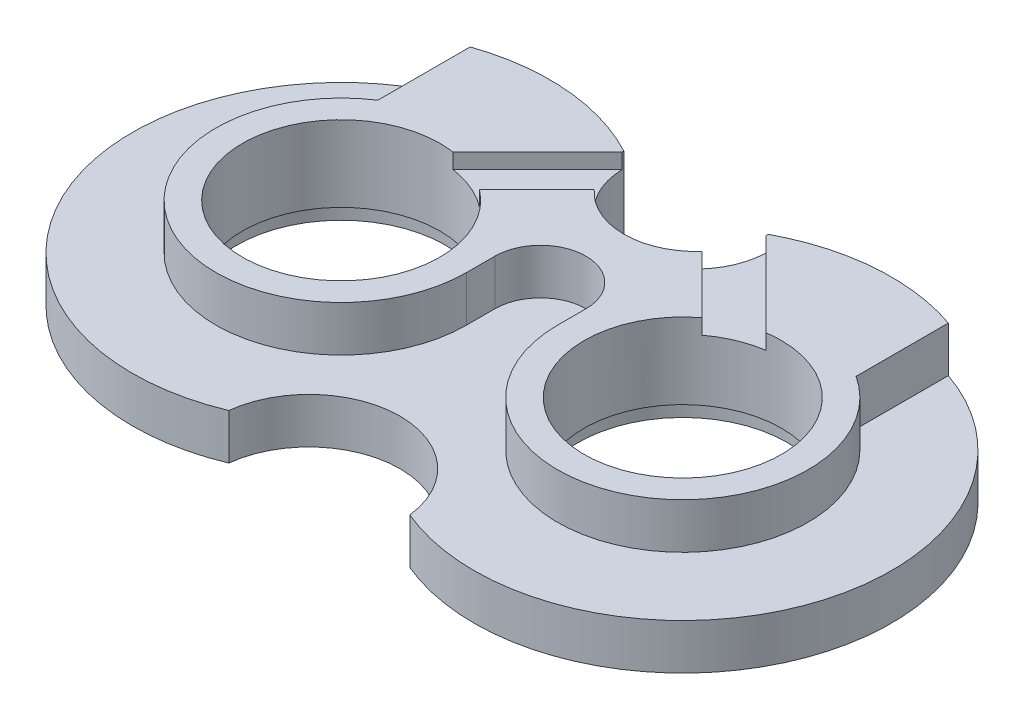
ISO-10303-21;
HEADER;
FILE_DESCRIPTION(('STEP AP214'),'2;1');
FILE_NAME('part.step','',(''),(''),'','','');
FILE_SCHEMA(('AUTOMOTIVE_DESIGN { 1 0 10303 214 1 1 1 1 }'));
ENDSEC;
DATA;
#1=APPLICATION_CONTEXT('core data for automotive mechanical design processes');
#2=APPLICATION_PROTOCOL_DEFINITION('international standard','automotive_design',2000,#1);
#3=PRODUCT_CONTEXT('',#1,'mechanical');
#4=PRODUCT('Part','Part','',(#3));
#5=PRODUCT_RELATED_PRODUCT_CATEGORY('part','',(#4));
#6=PRODUCT_DEFINITION_FORMATION('','',#4);
#7=PRODUCT_DEFINITION_CONTEXT('part definition',#1,'design');
#8=PRODUCT_DEFINITION('design','',#6,#7);
#9=PRODUCT_DEFINITION_SHAPE('','',#8);
#10=(LENGTH_UNIT() NAMED_UNIT(*) SI_UNIT(.MILLI.,.METRE.));
#11=(NAMED_UNIT(*) PLANE_ANGLE_UNIT() SI_UNIT($,.RADIAN.));
#12=(NAMED_UNIT(*) SI_UNIT($,.STERADIAN.) SOLID_ANGLE_UNIT());
#13=UNCERTAINTY_MEASURE_WITH_UNIT(LENGTH_MEASURE(1.E-05),#10,'distance_accuracy_value','');
#14=(GEOMETRIC_REPRESENTATION_CONTEXT(3) GLOBAL_UNCERTAINTY_ASSIGNED_CONTEXT((#13)) GLOBAL_UNIT_ASSIGNED_CONTEXT((#10,
#11,#12)) REPRESENTATION_CONTEXT('',''));
#15=CARTESIAN_POINT('',(0.,0.,0.));
#16=DIRECTION('',(0.,0.,1.));
#17=DIRECTION('',(1.,0.,0.));
#18=AXIS2_PLACEMENT_3D('',#15,#16,#17);
#19=CARTESIAN_POINT('',(22.5,12.,0.));
#20=DIRECTION('',(0.,-1.,0.));
#21=DIRECTION('',(0.,0.,-1.));
#22=AXIS2_PLACEMENT_3D('',#19,#20,#21);
#23=CYLINDRICAL_SURFACE('',#22,13.);
#24=DIRECTION('',(0.,-1.,0.));
#25=VECTOR('',#24,1.);
#26=CARTESIAN_POINT('',(20.6216910683662,12.,-12.8635903058728));
#27=LINE('',#26,#25);
#28=CARTESIAN_POINT('',(20.6216910683662,10.,-12.8635903058728));
#29=VERTEX_POINT('',#28);
#30=CARTESIAN_POINT('',(20.6216910683662,12.,-12.8635903058728));
#31=VERTEX_POINT('',#30);
#32=EDGE_CURVE('E276',#29,#31,#27,.F.);
#33=ORIENTED_EDGE('',*,*,#32,.F.);
#34=CARTESIAN_POINT('',(22.5,10.,0.));
#35=DIRECTION('',(0.,-1.,0.));
#36=DIRECTION('',(0.,0.,-1.));
#37=AXIS2_PLACEMENT_3D('',#34,#35,#36);
#38=CIRCLE('',#37,13.);
#39=CARTESIAN_POINT('',(14.6429971999567,10.,-10.3570028000436));
#40=VERTEX_POINT('',#39);
#41=EDGE_CURVE('E609',#40,#29,#38,.T.);
#42=ORIENTED_EDGE('',*,*,#41,.F.);
#43=DIRECTION('',(0.,-1.,0.));
#44=VECTOR('',#43,1.);
#45=CARTESIAN_POINT('',(14.6429971999567,12.,-10.3570028000436));
#46=LINE('',#45,#44);
#47=CARTESIAN_POINT('',(14.6429971999567,12.,-10.3570028000436));
#48=VERTEX_POINT('',#47);
#49=EDGE_CURVE('E280',#48,#40,#46,.T.);
#50=ORIENTED_EDGE('',*,*,#49,.F.);
#51=CARTESIAN_POINT('',(22.5,12.,0.));
#52=DIRECTION('',(0.,1.,0.));
#53=DIRECTION('',(0.,0.,1.));
#54=AXIS2_PLACEMENT_3D('',#51,#52,#53);
#55=CIRCLE('',#54,13.);
#56=EDGE_CURVE('E188',#48,#31,#55,.T.);
#57=ORIENTED_EDGE('',*,*,#56,.T.);
#58=EDGE_LOOP('',(#33,#42,#50,#57));
#59=FACE_BOUND('',#58,.T.);
#60=CARTESIAN_POINT('',(22.5,2.,0.));
#61=DIRECTION('',(0.,-1.,0.));
#62=DIRECTION('',(0.,0.,-1.));
#63=AXIS2_PLACEMENT_3D('',#60,#61,#62);
#64=CIRCLE('',#63,13.);
#65=CARTESIAN_POINT('',(22.5,2.,-13.));
#66=VERTEX_POINT('',#65);
#67=EDGE_CURVE('E230',#66,#66,#64,.T.);
#68=ORIENTED_EDGE('',*,*,#67,.T.);
#69=EDGE_LOOP('',(#68));
#70=FACE_BOUND('',#69,.T.);
#71=ADVANCED_FACE('F34',(#59,#70),#23,.F.);
#72=CARTESIAN_POINT('',(-22.5,12.,0.));
#73=DIRECTION('',(0.,-1.,0.));
#74=DIRECTION('',(0.,0.,-1.));
#75=AXIS2_PLACEMENT_3D('',#72,#73,#74);
#76=CYLINDRICAL_SURFACE('',#75,13.);
#77=DIRECTION('',(0.,-1.,0.));
#78=VECTOR('',#77,1.);
#79=CARTESIAN_POINT('',(-14.6429971999565,12.,-10.3570028000435));
#80=LINE('',#79,#78);
#81=CARTESIAN_POINT('',(-14.6429971999565,10.,-10.3570028000435));
#82=VERTEX_POINT('',#81);
#83=CARTESIAN_POINT('',(-14.6429971999565,12.,-10.3570028000435));
#84=VERTEX_POINT('',#83);
#85=EDGE_CURVE('E290',#82,#84,#80,.F.);
#86=ORIENTED_EDGE('',*,*,#85,.F.);
#87=CARTESIAN_POINT('',(-22.5,10.,0.));
#88=DIRECTION('',(0.,1.,0.));
#89=DIRECTION('',(0.,0.,1.));
#90=AXIS2_PLACEMENT_3D('',#87,#88,#89);
#91=CIRCLE('',#90,13.);
#92=CARTESIAN_POINT('',(-20.6216910683658,10.,-12.8635903058727));
#93=VERTEX_POINT('',#92);
#94=EDGE_CURVE('E285',#82,#93,#91,.T.);
#95=ORIENTED_EDGE('',*,*,#94,.T.);
#96=DIRECTION('',(0.,-1.,0.));
#97=VECTOR('',#96,1.);
#98=CARTESIAN_POINT('',(-20.6216910683658,12.,-12.8635903058727));
#99=LINE('',#98,#97);
#100=CARTESIAN_POINT('',(-20.6216910683658,12.,-12.8635903058727));
#101=VERTEX_POINT('',#100);
#102=EDGE_CURVE('E288',#101,#93,#99,.T.);
#103=ORIENTED_EDGE('',*,*,#102,.F.);
#104=CARTESIAN_POINT('',(-22.5,12.,0.));
#105=DIRECTION('',(0.,1.,0.));
#106=DIRECTION('',(0.,0.,1.));
#107=AXIS2_PLACEMENT_3D('',#104,#105,#106);
#108=CIRCLE('',#107,13.);
#109=EDGE_CURVE('E272',#101,#84,#108,.T.);
#110=ORIENTED_EDGE('',*,*,#109,.T.);
#111=EDGE_LOOP('',(#86,#95,#103,#110));
#112=FACE_BOUND('',#111,.T.);
#113=CARTESIAN_POINT('',(-22.5,2.,0.));
#114=DIRECTION('',(0.,-1.,0.));
#115=DIRECTION('',(0.,0.,-1.));
#116=AXIS2_PLACEMENT_3D('',#113,#114,#115);
#117=CIRCLE('',#116,13.);
#118=CARTESIAN_POINT('',(-22.5,2.,-13.));
#119=VERTEX_POINT('',#118);
#120=EDGE_CURVE('E226',#119,#119,#117,.T.);
#121=ORIENTED_EDGE('',*,*,#120,.T.);
#122=EDGE_LOOP('',(#121));
#123=FACE_BOUND('',#122,.T.);
#124=ADVANCED_FACE('F405',(#112,#123),#76,.F.);
#125=CARTESIAN_POINT('',(0.,12.,0.));
#126=DIRECTION('',(0.,1.,0.));
#127=DIRECTION('',(0.,0.,1.));
#128=AXIS2_PLACEMENT_3D('',#125,#126,#127);
#129=PLANE('',#128);
#130=DIRECTION('',(-0.707106781186552,0.,-0.707106781186544));
#131=VECTOR('',#130,1.);
#132=CARTESIAN_POINT('',(9.24264068711942,12.,-24.2426406871195));
#133=LINE('',#132,#131);
#134=CARTESIAN_POINT('',(9.49641045875851,12.,-23.9888709154804));
#135=VERTEX_POINT('',#134);
#136=EDGE_CURVE('E189',#31,#135,#133,.T.);
#137=ORIENTED_EDGE('',*,*,#136,.F.);
#138=ORIENTED_EDGE('',*,*,#56,.F.);
#139=DIRECTION('',(0.707106781186558,0.,0.707106781186537));
#140=VECTOR('',#139,1.);
#141=CARTESIAN_POINT('',(22.6776695296639,12.,-2.32233047033662));
#142=LINE('',#141,#140);
#143=CARTESIAN_POINT('',(7.08203921264818,12.,-17.9179607873519));
#144=VERTEX_POINT('',#143);
#145=EDGE_CURVE('E172',#144,#48,#142,.T.);
#146=ORIENTED_EDGE('',*,*,#145,.F.);
#147=CARTESIAN_POINT('',(0.,12.,-24.25));
#148=DIRECTION('',(0.,1.,0.));
#149=DIRECTION('',(0.,0.,1.));
#150=AXIS2_PLACEMENT_3D('',#147,#148,#149);
#151=CIRCLE('',#150,9.5);
#152=CARTESIAN_POINT('',(-7.08203921264815,12.,-17.9179607873518));
#153=VERTEX_POINT('',#152);
#154=EDGE_CURVE('E186',#153,#144,#151,.T.);
#155=ORIENTED_EDGE('',*,*,#154,.F.);
#156=DIRECTION('',(0.707106781186546,0.,-0.707106781186549));
#157=VECTOR('',#156,1.);
#158=CARTESIAN_POINT('',(-22.6776695296638,12.,-2.32233047033618));
#159=LINE('',#158,#157);
#160=EDGE_CURVE('E275',#84,#153,#159,.T.);
#161=ORIENTED_EDGE('',*,*,#160,.F.);
#162=ORIENTED_EDGE('',*,*,#109,.F.);
#163=DIRECTION('',(-0.707106781186546,0.,0.707106781186549));
#164=VECTOR('',#163,1.);
#165=CARTESIAN_POINT('',(-9.24264068711955,12.,-24.242640687119));
#166=LINE('',#165,#164);
#167=CARTESIAN_POINT('',(-9.4964104587585,12.,-23.9888709154801));
#168=VERTEX_POINT('',#167);
#169=EDGE_CURVE('E270',#168,#101,#166,.T.);
#170=ORIENTED_EDGE('',*,*,#169,.F.);
#171=CARTESIAN_POINT('',(-9.4999852047791,12.,-24.2332336951559));
#172=VERTEX_POINT('',#171);
#173=EDGE_CURVE('E196',#172,#168,#151,.T.);
#174=ORIENTED_EDGE('',*,*,#173,.F.);
#175=CARTESIAN_POINT('',(-22.5,12.,0.));
#176=DIRECTION('',(0.,1.,0.));
#177=DIRECTION('',(0.,0.,1.));
#178=AXIS2_PLACEMENT_3D('',#175,#176,#177);
#179=CIRCLE('',#178,27.5);
#180=CARTESIAN_POINT('',(-31.5,12.,-25.9855729203726));
#181=VERTEX_POINT('',#180);
#182=EDGE_CURVE('E210',#172,#181,#179,.T.);
#183=ORIENTED_EDGE('',*,*,#182,.T.);
#184=DIRECTION('',(0.,0.,-1.));
#185=VECTOR('',#184,1.);
#186=CARTESIAN_POINT('',(-31.5,12.,-40.));
#187=LINE('',#186,#185);
#188=CARTESIAN_POINT('',(-31.5,12.,-13.8293166859393));
#189=VERTEX_POINT('',#188);
#190=EDGE_CURVE('E328',#189,#181,#187,.T.);
#191=ORIENTED_EDGE('',*,*,#190,.F.);
#192=CARTESIAN_POINT('',(-22.5,12.,0.));
#193=DIRECTION('',(0.,-1.,0.));
#194=DIRECTION('',(0.,0.,1.));
#195=AXIS2_PLACEMENT_3D('',#192,#193,#194);
#196=CIRCLE('',#195,16.5);
#197=CARTESIAN_POINT('',(-6.,12.,0.));
#198=VERTEX_POINT('',#197);
#199=EDGE_CURVE('E303',#198,#189,#196,.T.);
#200=ORIENTED_EDGE('',*,*,#199,.F.);
#201=DIRECTION('',(0.,0.,1.));
#202=VECTOR('',#201,1.);
#203=CARTESIAN_POINT('',(-6.,12.,0.));
#204=LINE('',#203,#202);
#205=CARTESIAN_POINT('',(-6.,12.,-3.75));
#206=VERTEX_POINT('',#205);
#207=EDGE_CURVE('E308',#206,#198,#204,.T.);
#208=ORIENTED_EDGE('',*,*,#207,.F.);
#209=CARTESIAN_POINT('',(0.,12.,-3.75));
#210=DIRECTION('',(0.,1.,0.));
#211=DIRECTION('',(0.,0.,-1.));
#212=AXIS2_PLACEMENT_3D('',#209,#210,#211);
#213=CIRCLE('',#212,6.);
#214=CARTESIAN_POINT('',(6.,12.,-3.75));
#215=VERTEX_POINT('',#214);
#216=EDGE_CURVE('E337',#215,#206,#213,.T.);
#217=ORIENTED_EDGE('',*,*,#216,.F.);
#218=DIRECTION('',(0.,0.,-1.));
#219=VECTOR('',#218,1.);
#220=CARTESIAN_POINT('',(6.,12.,0.));
#221=LINE('',#220,#219);
#222=CARTESIAN_POINT('',(6.,12.,0.));
#223=VERTEX_POINT('',#222);
#224=EDGE_CURVE('E334',#223,#215,#221,.T.);
#225=ORIENTED_EDGE('',*,*,#224,.F.);
#226=CARTESIAN_POINT('',(22.5,12.,0.));
#227=DIRECTION('',(0.,-1.,0.));
#228=DIRECTION('',(0.,0.,1.));
#229=AXIS2_PLACEMENT_3D('',#226,#227,#228);
#230=CIRCLE('',#229,16.5);
#231=CARTESIAN_POINT('',(31.5,12.,-13.8293166859393));
#232=VERTEX_POINT('',#231);
#233=EDGE_CURVE('E331',#232,#223,#230,.T.);
#234=ORIENTED_EDGE('',*,*,#233,.F.);
#235=DIRECTION('',(0.,0.,1.));
#236=VECTOR('',#235,1.);
#237=CARTESIAN_POINT('',(31.5,12.,-40.));
#238=LINE('',#237,#236);
#239=CARTESIAN_POINT('',(31.5,12.,-25.9855729203726));
#240=VERTEX_POINT('',#239);
#241=EDGE_CURVE('E247',#240,#232,#238,.T.);
#242=ORIENTED_EDGE('',*,*,#241,.F.);
#243=CARTESIAN_POINT('',(22.5,12.,0.));
#244=DIRECTION('',(0.,1.,0.));
#245=DIRECTION('',(0.,0.,1.));
#246=AXIS2_PLACEMENT_3D('',#243,#244,#245);
#247=CIRCLE('',#246,27.5);
#248=CARTESIAN_POINT('',(9.4999852047791,12.,-24.2332336951559));
#249=VERTEX_POINT('',#248);
#250=EDGE_CURVE('E213',#240,#249,#247,.T.);
#251=ORIENTED_EDGE('',*,*,#250,.T.);
#252=EDGE_CURVE('E197',#135,#249,#151,.T.);
#253=ORIENTED_EDGE('',*,*,#252,.F.);
#254=EDGE_LOOP('',(#137,#138,#146,#155,#161,#162,#170,#174,#183,#191,#200,#208,#217,#225,#234,
#242,#251,#253));
#255=FACE_BOUND('',#254,.T.);
#256=ADVANCED_FACE('F184',(#255),#129,.T.);
#257=CARTESIAN_POINT('',(0.,0.,0.));
#258=DIRECTION('',(0.,1.,0.));
#259=DIRECTION('',(0.,0.,1.));
#260=AXIS2_PLACEMENT_3D('',#257,#258,#259);
#261=PLANE('',#260);
#262=CARTESIAN_POINT('',(22.5,0.,0.));
#263=DIRECTION('',(0.,-1.,0.));
#264=DIRECTION('',(0.,0.,-1.));
#265=AXIS2_PLACEMENT_3D('',#262,#263,#264);
#266=CIRCLE('',#265,13.75);
#267=CARTESIAN_POINT('',(22.5,0.,-13.75));
#268=VERTEX_POINT('',#267);
#269=EDGE_CURVE('E292',#268,#268,#266,.T.);
#270=ORIENTED_EDGE('',*,*,#269,.F.);
#271=EDGE_LOOP('',(#270));
#272=FACE_BOUND('',#271,.T.);
#273=CARTESIAN_POINT('',(-22.5,0.,0.));
#274=DIRECTION('',(0.,-1.,0.));
#275=DIRECTION('',(0.,0.,-1.));
#276=AXIS2_PLACEMENT_3D('',#273,#274,#275);
#277=CIRCLE('',#276,13.75);
#278=CARTESIAN_POINT('',(-22.5,0.,-13.75));
#279=VERTEX_POINT('',#278);
#280=EDGE_CURVE('E233',#279,#279,#277,.T.);
#281=ORIENTED_EDGE('',*,*,#280,.F.);
#282=EDGE_LOOP('',(#281));
#283=FACE_BOUND('',#282,.T.);
#284=CARTESIAN_POINT('',(0.,0.,26.75));
#285=DIRECTION('',(0.,1.,0.));
#286=DIRECTION('',(0.,0.,1.));
#287=AXIS2_PLACEMENT_3D('',#284,#285,#286);
#288=CIRCLE('',#287,12.);
#289=CARTESIAN_POINT('',(11.9220182875869,0.,25.3841742605871));
#290=VERTEX_POINT('',#289);
#291=CARTESIAN_POINT('',(-11.9220182875869,0.,25.3841742605871));
#292=VERTEX_POINT('',#291);
#293=EDGE_CURVE('E259',#290,#292,#288,.T.);
#294=ORIENTED_EDGE('',*,*,#293,.T.);
#295=CARTESIAN_POINT('',(-22.5,0.,0.));
#296=DIRECTION('',(0.,1.,0.));
#297=DIRECTION('',(0.,0.,1.));
#298=AXIS2_PLACEMENT_3D('',#295,#296,#297);
#299=CIRCLE('',#298,27.5);
#300=CARTESIAN_POINT('',(-9.4999852047791,0.,-24.2332336951559));
#301=VERTEX_POINT('',#300);
#302=EDGE_CURVE('E209',#301,#292,#299,.T.);
#303=ORIENTED_EDGE('',*,*,#302,.F.);
#304=CARTESIAN_POINT('',(0.,0.,-24.25));
#305=DIRECTION('',(0.,1.,0.));
#306=DIRECTION('',(0.,0.,1.));
#307=AXIS2_PLACEMENT_3D('',#304,#305,#306);
#308=CIRCLE('',#307,9.5);
#309=CARTESIAN_POINT('',(9.49998520477911,0.,-24.2332336951559));
#310=VERTEX_POINT('',#309);
#311=EDGE_CURVE('E217',#310,#301,#308,.F.);
#312=ORIENTED_EDGE('',*,*,#311,.F.);
#313=CARTESIAN_POINT('',(22.5,0.,0.));
#314=DIRECTION('',(0.,1.,0.));
#315=DIRECTION('',(0.,0.,1.));
#316=AXIS2_PLACEMENT_3D('',#313,#314,#315);
#317=CIRCLE('',#316,27.5);
#318=EDGE_CURVE('E214',#290,#310,#317,.T.);
#319=ORIENTED_EDGE('',*,*,#318,.F.);
#320=EDGE_LOOP('',(#294,#303,#312,#319));
#321=FACE_BOUND('',#320,.T.);
#322=ADVANCED_FACE('F258',(#272,#283,#321),#261,.F.);
#323=CARTESIAN_POINT('',(0.,12.,26.75));
#324=DIRECTION('',(0.,-1.,0.));
#325=DIRECTION('',(0.,0.,-1.));
#326=AXIS2_PLACEMENT_3D('',#323,#324,#325);
#327=CYLINDRICAL_SURFACE('',#326,12.);
#328=DIRECTION('',(0.,-1.,0.));
#329=VECTOR('',#328,1.);
#330=CARTESIAN_POINT('',(11.9220182875869,6.,25.3841742605871));
#331=LINE('',#330,#329);
#332=CARTESIAN_POINT('',(11.9220182875869,6.,25.3841742605871));
#333=VERTEX_POINT('',#332);
#334=EDGE_CURVE('E362',#290,#333,#331,.F.);
#335=ORIENTED_EDGE('',*,*,#334,.T.);
#336=CARTESIAN_POINT('',(0.,6.,26.75));
#337=DIRECTION('',(0.,1.,0.));
#338=DIRECTION('',(0.,0.,1.));
#339=AXIS2_PLACEMENT_3D('',#336,#337,#338);
#340=CIRCLE('',#339,12.);
#341=CARTESIAN_POINT('',(-11.9220182875869,6.,25.3841742605871));
#342=VERTEX_POINT('',#341);
#343=EDGE_CURVE('E222',#333,#342,#340,.T.);
#344=ORIENTED_EDGE('',*,*,#343,.T.);
#345=DIRECTION('',(0.,-1.,0.));
#346=VECTOR('',#345,1.);
#347=CARTESIAN_POINT('',(-11.9220182875869,6.,25.3841742605871));
#348=LINE('',#347,#346);
#349=EDGE_CURVE('E201',#342,#292,#348,.T.);
#350=ORIENTED_EDGE('',*,*,#349,.T.);
#351=ORIENTED_EDGE('',*,*,#293,.F.);
#352=EDGE_LOOP('',(#335,#344,#350,#351));
#353=FACE_BOUND('',#352,.T.);
#354=ADVANCED_FACE('F365',(#353),#327,.F.);
#355=CARTESIAN_POINT('',(-22.5,12.,0.));
#356=DIRECTION('',(0.,-1.,0.));
#357=DIRECTION('',(0.,0.,-1.));
#358=AXIS2_PLACEMENT_3D('',#355,#356,#357);
#359=CYLINDRICAL_SURFACE('',#358,27.5);
#360=CARTESIAN_POINT('',(-22.5,6.,0.));
#361=DIRECTION('',(0.,1.,0.));
#362=DIRECTION('',(0.,0.,1.));
#363=AXIS2_PLACEMENT_3D('',#360,#361,#362);
#364=CIRCLE('',#363,27.5);
#365=CARTESIAN_POINT('',(-31.5,6.,-25.9855729203726));
#366=VERTEX_POINT('',#365);
#367=EDGE_CURVE('E356',#366,#342,#364,.T.);
#368=ORIENTED_EDGE('',*,*,#367,.F.);
#369=DIRECTION('',(0.,-1.,0.));
#370=VECTOR('',#369,1.);
#371=CARTESIAN_POINT('',(-31.5,12.,-25.9855729203726));
#372=LINE('',#371,#370);
#373=EDGE_CURVE('E358',#366,#181,#372,.F.);
#374=ORIENTED_EDGE('',*,*,#373,.T.);
#375=ORIENTED_EDGE('',*,*,#182,.F.);
#376=DIRECTION('',(0.,-1.,0.));
#377=VECTOR('',#376,1.);
#378=CARTESIAN_POINT('',(-9.4999852047791,6.,-24.2332336951559));
#379=LINE('',#378,#377);
#380=EDGE_CURVE('E207',#301,#172,#379,.F.);
#381=ORIENTED_EDGE('',*,*,#380,.F.);
#382=ORIENTED_EDGE('',*,*,#302,.T.);
#383=ORIENTED_EDGE('',*,*,#349,.F.);
#384=EDGE_LOOP('',(#368,#374,#375,#381,#382,#383));
#385=FACE_BOUND('',#384,.T.);
#386=ADVANCED_FACE('F36',(#385),#359,.T.);
#387=CARTESIAN_POINT('',(22.5,12.,0.));
#388=DIRECTION('',(0.,-1.,0.));
#389=DIRECTION('',(0.,0.,-1.));
#390=AXIS2_PLACEMENT_3D('',#387,#388,#389);
#391=CYLINDRICAL_SURFACE('',#390,27.5);
#392=ORIENTED_EDGE('',*,*,#250,.F.);
#393=DIRECTION('',(0.,-1.,0.));
#394=VECTOR('',#393,1.);
#395=CARTESIAN_POINT('',(31.5,12.,-25.9855729203726));
#396=LINE('',#395,#394);
#397=CARTESIAN_POINT('',(31.5,6.,-25.9855729203726));
#398=VERTEX_POINT('',#397);
#399=EDGE_CURVE('E360',#240,#398,#396,.T.);
#400=ORIENTED_EDGE('',*,*,#399,.T.);
#401=CARTESIAN_POINT('',(22.5,6.,0.));
#402=DIRECTION('',(0.,1.,0.));
#403=DIRECTION('',(0.,0.,1.));
#404=AXIS2_PLACEMENT_3D('',#401,#402,#403);
#405=CIRCLE('',#404,27.5);
#406=EDGE_CURVE('E344',#333,#398,#405,.T.);
#407=ORIENTED_EDGE('',*,*,#406,.F.);
#408=ORIENTED_EDGE('',*,*,#334,.F.);
#409=ORIENTED_EDGE('',*,*,#318,.T.);
#410=DIRECTION('',(0.,-1.,0.));
#411=VECTOR('',#410,1.);
#412=CARTESIAN_POINT('',(9.4999852047791,6.,-24.2332336951559));
#413=LINE('',#412,#411);
#414=EDGE_CURVE('E200',#249,#310,#413,.T.);
#415=ORIENTED_EDGE('',*,*,#414,.F.);
#416=EDGE_LOOP('',(#392,#400,#407,#408,#409,#415));
#417=FACE_BOUND('',#416,.T.);
#418=ADVANCED_FACE('F250',(#417),#391,.T.);
#419=CARTESIAN_POINT('',(0.,12.,-24.25));
#420=DIRECTION('',(0.,-1.,0.));
#421=DIRECTION('',(0.,0.,-1.));
#422=AXIS2_PLACEMENT_3D('',#419,#420,#421);
#423=CYLINDRICAL_SURFACE('',#422,9.5);
#424=DIRECTION('',(0.,-1.,0.));
#425=VECTOR('',#424,1.);
#426=CARTESIAN_POINT('',(9.49641045875851,12.,-23.9888709154804));
#427=LINE('',#426,#425);
#428=CARTESIAN_POINT('',(9.49641045875851,10.,-23.9888709154804));
#429=VERTEX_POINT('',#428);
#430=EDGE_CURVE('E11',#135,#429,#427,.T.);
#431=ORIENTED_EDGE('',*,*,#430,.F.);
#432=ORIENTED_EDGE('',*,*,#252,.T.);
#433=ORIENTED_EDGE('',*,*,#414,.T.);
#434=ORIENTED_EDGE('',*,*,#311,.T.);
#435=ORIENTED_EDGE('',*,*,#380,.T.);
#436=ORIENTED_EDGE('',*,*,#173,.T.);
#437=DIRECTION('',(0.,-1.,0.));
#438=VECTOR('',#437,1.);
#439=CARTESIAN_POINT('',(-9.4964104587585,12.,-23.9888709154801));
#440=LINE('',#439,#438);
#441=CARTESIAN_POINT('',(-9.4964104587585,10.,-23.9888709154801));
#442=VERTEX_POINT('',#441);
#443=EDGE_CURVE('E236',#442,#168,#440,.F.);
#444=ORIENTED_EDGE('',*,*,#443,.F.);
#445=CARTESIAN_POINT('',(0.,10.,-24.25));
#446=DIRECTION('',(0.,1.,0.));
#447=DIRECTION('',(0.,0.,1.));
#448=AXIS2_PLACEMENT_3D('',#445,#446,#447);
#449=CIRCLE('',#448,9.5);
#450=CARTESIAN_POINT('',(-7.08203921264815,10.,-17.9179607873518));
#451=VERTEX_POINT('',#450);
#452=EDGE_CURVE('E225',#442,#451,#449,.T.);
#453=ORIENTED_EDGE('',*,*,#452,.T.);
#454=DIRECTION('',(0.,-1.,0.));
#455=VECTOR('',#454,1.);
#456=CARTESIAN_POINT('',(-7.08203921264815,12.,-17.9179607873518));
#457=LINE('',#456,#455);
#458=EDGE_CURVE('E195',#153,#451,#457,.T.);
#459=ORIENTED_EDGE('',*,*,#458,.F.);
#460=ORIENTED_EDGE('',*,*,#154,.T.);
#461=DIRECTION('',(0.,-1.,0.));
#462=VECTOR('',#461,1.);
#463=CARTESIAN_POINT('',(7.08203921264818,12.,-17.9179607873519));
#464=LINE('',#463,#462);
#465=CARTESIAN_POINT('',(7.08203921264818,10.,-17.9179607873519));
#466=VERTEX_POINT('',#465);
#467=EDGE_CURVE('E42',#466,#144,#464,.F.);
#468=ORIENTED_EDGE('',*,*,#467,.F.);
#469=CARTESIAN_POINT('',(0.,10.,-24.25));
#470=DIRECTION('',(0.,-1.,0.));
#471=DIRECTION('',(0.,0.,-1.));
#472=AXIS2_PLACEMENT_3D('',#469,#470,#471);
#473=CIRCLE('',#472,9.5);
#474=EDGE_CURVE('E179',#429,#466,#473,.T.);
#475=ORIENTED_EDGE('',*,*,#474,.F.);
#476=EDGE_LOOP('',(#431,#432,#433,#434,#435,#436,#444,#453,#459,#460,#468,#475));
#477=FACE_BOUND('',#476,.T.);
#478=ADVANCED_FACE('F193',(#477),#423,.F.);
#479=CARTESIAN_POINT('',(31.5,6.,-40.));
#480=DIRECTION('',(-1.,0.,0.));
#481=DIRECTION('',(0.,0.,1.));
#482=AXIS2_PLACEMENT_3D('',#479,#480,#481);
#483=PLANE('',#482);
#484=ORIENTED_EDGE('',*,*,#241,.T.);
#485=DIRECTION('',(0.,1.,0.));
#486=VECTOR('',#485,1.);
#487=CARTESIAN_POINT('',(31.5,6.,-13.8293166859393));
#488=LINE('',#487,#486);
#489=CARTESIAN_POINT('',(31.5,6.,-13.8293166859393));
#490=VERTEX_POINT('',#489);
#491=EDGE_CURVE('E351',#490,#232,#488,.T.);
#492=ORIENTED_EDGE('',*,*,#491,.F.);
#493=DIRECTION('',(0.,0.,1.));
#494=VECTOR('',#493,1.);
#495=CARTESIAN_POINT('',(31.5,6.,-40.));
#496=LINE('',#495,#494);
#497=EDGE_CURVE('E311',#398,#490,#496,.T.);
#498=ORIENTED_EDGE('',*,*,#497,.F.);
#499=ORIENTED_EDGE('',*,*,#399,.F.);
#500=EDGE_LOOP('',(#484,#492,#498,#499));
#501=FACE_BOUND('',#500,.T.);
#502=ADVANCED_FACE('F371',(#501),#483,.F.);
#503=CARTESIAN_POINT('',(-31.5,6.,-40.));
#504=DIRECTION('',(1.,0.,0.));
#505=DIRECTION('',(0.,0.,-1.));
#506=AXIS2_PLACEMENT_3D('',#503,#504,#505);
#507=PLANE('',#506);
#508=DIRECTION('',(0.,0.,-1.));
#509=VECTOR('',#508,1.);
#510=CARTESIAN_POINT('',(-31.5,6.,-40.));
#511=LINE('',#510,#509);
#512=CARTESIAN_POINT('',(-31.5,6.,-13.8293166859393));
#513=VERTEX_POINT('',#512);
#514=EDGE_CURVE('E307',#513,#366,#511,.T.);
#515=ORIENTED_EDGE('',*,*,#514,.F.);
#516=DIRECTION('',(0.,1.,0.));
#517=VECTOR('',#516,1.);
#518=CARTESIAN_POINT('',(-31.5,6.,-13.8293166859393));
#519=LINE('',#518,#517);
#520=EDGE_CURVE('E325',#513,#189,#519,.T.);
#521=ORIENTED_EDGE('',*,*,#520,.T.);
#522=ORIENTED_EDGE('',*,*,#190,.T.);
#523=ORIENTED_EDGE('',*,*,#373,.F.);
#524=EDGE_LOOP('',(#515,#521,#522,#523));
#525=FACE_BOUND('',#524,.T.);
#526=ADVANCED_FACE('F394',(#525),#507,.F.);
#527=CARTESIAN_POINT('',(-22.5,6.,0.));
#528=DIRECTION('',(0.,1.,0.));
#529=DIRECTION('',(0.,0.,1.));
#530=AXIS2_PLACEMENT_3D('',#527,#528,#529);
#531=PLANE('',#530);
#532=ORIENTED_EDGE('',*,*,#367,.T.);
#533=ORIENTED_EDGE('',*,*,#343,.F.);
#534=ORIENTED_EDGE('',*,*,#406,.T.);
#535=ORIENTED_EDGE('',*,*,#497,.T.);
#536=CARTESIAN_POINT('',(22.5,6.,0.));
#537=DIRECTION('',(0.,-1.,0.));
#538=DIRECTION('',(0.,0.,1.));
#539=AXIS2_PLACEMENT_3D('',#536,#537,#538);
#540=CIRCLE('',#539,16.5);
#541=CARTESIAN_POINT('',(6.,6.,0.));
#542=VERTEX_POINT('',#541);
#543=EDGE_CURVE('E313',#490,#542,#540,.T.);
#544=ORIENTED_EDGE('',*,*,#543,.T.);
#545=DIRECTION('',(0.,0.,-1.));
#546=VECTOR('',#545,1.);
#547=CARTESIAN_POINT('',(6.,6.,0.));
#548=LINE('',#547,#546);
#549=CARTESIAN_POINT('',(6.,6.,-3.75));
#550=VERTEX_POINT('',#549);
#551=EDGE_CURVE('E316',#542,#550,#548,.T.);
#552=ORIENTED_EDGE('',*,*,#551,.T.);
#553=CARTESIAN_POINT('',(0.,6.,-3.75));
#554=DIRECTION('',(0.,1.,0.));
#555=DIRECTION('',(0.,0.,-1.));
#556=AXIS2_PLACEMENT_3D('',#553,#554,#555);
#557=CIRCLE('',#556,6.);
#558=CARTESIAN_POINT('',(-6.,6.,-3.75));
#559=VERTEX_POINT('',#558);
#560=EDGE_CURVE('E319',#550,#559,#557,.T.);
#561=ORIENTED_EDGE('',*,*,#560,.T.);
#562=DIRECTION('',(0.,0.,1.));
#563=VECTOR('',#562,1.);
#564=CARTESIAN_POINT('',(-6.,6.,0.));
#565=LINE('',#564,#563);
#566=CARTESIAN_POINT('',(-6.,6.,0.));
#567=VERTEX_POINT('',#566);
#568=EDGE_CURVE('E322',#559,#567,#565,.T.);
#569=ORIENTED_EDGE('',*,*,#568,.T.);
#570=CARTESIAN_POINT('',(-22.5,6.,0.));
#571=DIRECTION('',(0.,-1.,0.));
#572=DIRECTION('',(0.,0.,1.));
#573=AXIS2_PLACEMENT_3D('',#570,#571,#572);
#574=CIRCLE('',#573,16.5);
#575=EDGE_CURVE('E304',#567,#513,#574,.T.);
#576=ORIENTED_EDGE('',*,*,#575,.T.);
#577=ORIENTED_EDGE('',*,*,#514,.T.);
#578=EDGE_LOOP('',(#532,#533,#534,#535,#544,#552,#561,#569,#576,#577));
#579=FACE_BOUND('',#578,.T.);
#580=ADVANCED_FACE('F368',(#579),#531,.T.);
#581=CARTESIAN_POINT('',(-22.5,6.,0.));
#582=DIRECTION('',(0.,1.,0.));
#583=DIRECTION('',(0.,0.,1.));
#584=AXIS2_PLACEMENT_3D('',#581,#582,#583);
#585=CYLINDRICAL_SURFACE('',#584,16.5);
#586=ORIENTED_EDGE('',*,*,#199,.T.);
#587=ORIENTED_EDGE('',*,*,#520,.F.);
#588=ORIENTED_EDGE('',*,*,#575,.F.);
#589=DIRECTION('',(0.,1.,0.));
#590=VECTOR('',#589,1.);
#591=CARTESIAN_POINT('',(-6.,6.,0.));
#592=LINE('',#591,#590);
#593=EDGE_CURVE('E342',#567,#198,#592,.T.);
#594=ORIENTED_EDGE('',*,*,#593,.T.);
#595=EDGE_LOOP('',(#586,#587,#588,#594));
#596=FACE_BOUND('',#595,.T.);
#597=ADVANCED_FACE('F391',(#596),#585,.T.);
#598=CARTESIAN_POINT('',(-6.,6.,0.));
#599=DIRECTION('',(-1.,0.,0.));
#600=DIRECTION('',(0.,0.,1.));
#601=AXIS2_PLACEMENT_3D('',#598,#599,#600);
#602=PLANE('',#601);
#603=ORIENTED_EDGE('',*,*,#207,.T.);
#604=ORIENTED_EDGE('',*,*,#593,.F.);
#605=ORIENTED_EDGE('',*,*,#568,.F.);
#606=DIRECTION('',(0.,1.,0.));
#607=VECTOR('',#606,1.);
#608=CARTESIAN_POINT('',(-6.,6.,-3.75));
#609=LINE('',#608,#607);
#610=EDGE_CURVE('E345',#559,#206,#609,.T.);
#611=ORIENTED_EDGE('',*,*,#610,.T.);
#612=EDGE_LOOP('',(#603,#604,#605,#611));
#613=FACE_BOUND('',#612,.T.);
#614=ADVANCED_FACE('F386',(#613),#602,.F.);
#615=CARTESIAN_POINT('',(0.,6.,-3.75));
#616=DIRECTION('',(0.,1.,0.));
#617=DIRECTION('',(0.,0.,1.));
#618=AXIS2_PLACEMENT_3D('',#615,#616,#617);
#619=CYLINDRICAL_SURFACE('',#618,6.);
#620=ORIENTED_EDGE('',*,*,#216,.T.);
#621=ORIENTED_EDGE('',*,*,#610,.F.);
#622=ORIENTED_EDGE('',*,*,#560,.F.);
#623=DIRECTION('',(0.,1.,0.));
#624=VECTOR('',#623,1.);
#625=CARTESIAN_POINT('',(6.,6.,-3.75));
#626=LINE('',#625,#624);
#627=EDGE_CURVE('E347',#550,#215,#626,.T.);
#628=ORIENTED_EDGE('',*,*,#627,.T.);
#629=EDGE_LOOP('',(#620,#621,#622,#628));
#630=FACE_BOUND('',#629,.T.);
#631=ADVANCED_FACE('F383',(#630),#619,.F.);
#632=CARTESIAN_POINT('',(6.,6.,0.));
#633=DIRECTION('',(1.,0.,0.));
#634=DIRECTION('',(0.,0.,-1.));
#635=AXIS2_PLACEMENT_3D('',#632,#633,#634);
#636=PLANE('',#635);
#637=ORIENTED_EDGE('',*,*,#224,.T.);
#638=ORIENTED_EDGE('',*,*,#627,.F.);
#639=ORIENTED_EDGE('',*,*,#551,.F.);
#640=DIRECTION('',(0.,1.,0.));
#641=VECTOR('',#640,1.);
#642=CARTESIAN_POINT('',(6.,6.,0.));
#643=LINE('',#642,#641);
#644=EDGE_CURVE('E349',#542,#223,#643,.T.);
#645=ORIENTED_EDGE('',*,*,#644,.T.);
#646=EDGE_LOOP('',(#637,#638,#639,#645));
#647=FACE_BOUND('',#646,.T.);
#648=ADVANCED_FACE('F379',(#647),#636,.F.);
#649=CARTESIAN_POINT('',(22.5,6.,0.));
#650=DIRECTION('',(0.,1.,0.));
#651=DIRECTION('',(0.,0.,1.));
#652=AXIS2_PLACEMENT_3D('',#649,#650,#651);
#653=CYLINDRICAL_SURFACE('',#652,16.5);
#654=ORIENTED_EDGE('',*,*,#233,.T.);
#655=ORIENTED_EDGE('',*,*,#644,.F.);
#656=ORIENTED_EDGE('',*,*,#543,.F.);
#657=ORIENTED_EDGE('',*,*,#491,.T.);
#658=EDGE_LOOP('',(#654,#655,#656,#657));
#659=FACE_BOUND('',#658,.T.);
#660=ADVANCED_FACE('F376',(#659),#653,.T.);
#661=CARTESIAN_POINT('',(-22.5,2.,0.));
#662=DIRECTION('',(0.,-1.,0.));
#663=DIRECTION('',(0.,0.,-1.));
#664=AXIS2_PLACEMENT_3D('',#661,#662,#663);
#665=CYLINDRICAL_SURFACE('',#664,13.75);
#666=CARTESIAN_POINT('',(-22.5,2.,0.));
#667=DIRECTION('',(0.,-1.,0.));
#668=DIRECTION('',(0.,0.,-1.));
#669=AXIS2_PLACEMENT_3D('',#666,#667,#668);
#670=CIRCLE('',#669,13.75);
#671=CARTESIAN_POINT('',(-22.5,2.,-13.75));
#672=VERTEX_POINT('',#671);
#673=EDGE_CURVE('E229',#672,#672,#670,.T.);
#674=ORIENTED_EDGE('',*,*,#673,.F.);
#675=EDGE_LOOP('',(#674));
#676=FACE_BOUND('',#675,.T.);
#677=ORIENTED_EDGE('',*,*,#280,.T.);
#678=EDGE_LOOP('',(#677));
#679=FACE_BOUND('',#678,.T.);
#680=ADVANCED_FACE('F416',(#676,#679),#665,.F.);
#681=CARTESIAN_POINT('',(-22.5,2.,0.));
#682=DIRECTION('',(0.,-1.,0.));
#683=DIRECTION('',(0.,0.,-1.));
#684=AXIS2_PLACEMENT_3D('',#681,#682,#683);
#685=PLANE('',#684);
#686=ORIENTED_EDGE('',*,*,#120,.F.);
#687=EDGE_LOOP('',(#686));
#688=FACE_BOUND('',#687,.T.);
#689=ORIENTED_EDGE('',*,*,#673,.T.);
#690=EDGE_LOOP('',(#689));
#691=FACE_BOUND('',#690,.T.);
#692=ADVANCED_FACE('F429',(#688,#691),#685,.T.);
#693=CARTESIAN_POINT('',(22.5,2.,0.));
#694=DIRECTION('',(0.,-1.,0.));
#695=DIRECTION('',(0.,0.,-1.));
#696=AXIS2_PLACEMENT_3D('',#693,#694,#695);
#697=CYLINDRICAL_SURFACE('',#696,13.75);
#698=CARTESIAN_POINT('',(22.5,2.,0.));
#699=DIRECTION('',(0.,-1.,0.));
#700=DIRECTION('',(0.,0.,-1.));
#701=AXIS2_PLACEMENT_3D('',#698,#699,#700);
#702=CIRCLE('',#701,13.75);
#703=CARTESIAN_POINT('',(22.5,2.,-13.75));
#704=VERTEX_POINT('',#703);
#705=EDGE_CURVE('E234',#704,#704,#702,.T.);
#706=ORIENTED_EDGE('',*,*,#705,.F.);
#707=EDGE_LOOP('',(#706));
#708=FACE_BOUND('',#707,.T.);
#709=ORIENTED_EDGE('',*,*,#269,.T.);
#710=EDGE_LOOP('',(#709));
#711=FACE_BOUND('',#710,.T.);
#712=ADVANCED_FACE('F434',(#708,#711),#697,.F.);
#713=CARTESIAN_POINT('',(22.5,2.,0.));
#714=DIRECTION('',(0.,-1.,0.));
#715=DIRECTION('',(0.,0.,-1.));
#716=AXIS2_PLACEMENT_3D('',#713,#714,#715);
#717=PLANE('',#716);
#718=ORIENTED_EDGE('',*,*,#67,.F.);
#719=EDGE_LOOP('',(#718));
#720=FACE_BOUND('',#719,.T.);
#721=ORIENTED_EDGE('',*,*,#705,.T.);
#722=EDGE_LOOP('',(#721));
#723=FACE_BOUND('',#722,.T.);
#724=ADVANCED_FACE('F543',(#720,#723),#717,.T.);
#725=CARTESIAN_POINT('',(-22.6776695296638,10.,-2.32233047033618));
#726=DIRECTION('',(0.707106781186549,0.,0.707106781186546));
#727=DIRECTION('',(0.707106781186546,0.,-0.707106781186549));
#728=AXIS2_PLACEMENT_3D('',#725,#726,#727);
#729=PLANE('',#728);
#730=ORIENTED_EDGE('',*,*,#85,.T.);
#731=ORIENTED_EDGE('',*,*,#160,.T.);
#732=ORIENTED_EDGE('',*,*,#458,.T.);
#733=DIRECTION('',(0.707106781186546,0.,-0.707106781186549));
#734=VECTOR('',#733,1.);
#735=CARTESIAN_POINT('',(-22.6776695296638,10.,-2.32233047033618));
#736=LINE('',#735,#734);
#737=EDGE_CURVE('E56',#82,#451,#736,.T.);
#738=ORIENTED_EDGE('',*,*,#737,.F.);
#739=EDGE_LOOP('',(#730,#731,#732,#738));
#740=FACE_BOUND('',#739,.T.);
#741=ADVANCED_FACE('F551',(#740),#729,.F.);
#742=CARTESIAN_POINT('',(-9.24264068711955,10.,-24.242640687119));
#743=DIRECTION('',(-0.707106781186549,0.,-0.707106781186546));
#744=DIRECTION('',(-0.707106781186546,0.,0.707106781186549));
#745=AXIS2_PLACEMENT_3D('',#742,#743,#744);
#746=PLANE('',#745);
#747=ORIENTED_EDGE('',*,*,#102,.T.);
#748=DIRECTION('',(-0.707106781186546,0.,0.707106781186549));
#749=VECTOR('',#748,1.);
#750=CARTESIAN_POINT('',(-9.24264068711955,10.,-24.242640687119));
#751=LINE('',#750,#749);
#752=EDGE_CURVE('E278',#442,#93,#751,.T.);
#753=ORIENTED_EDGE('',*,*,#752,.F.);
#754=ORIENTED_EDGE('',*,*,#443,.T.);
#755=ORIENTED_EDGE('',*,*,#169,.T.);
#756=EDGE_LOOP('',(#747,#753,#754,#755));
#757=FACE_BOUND('',#756,.T.);
#758=ADVANCED_FACE('F560',(#757),#746,.F.);
#759=CARTESIAN_POINT('',(0.,10.,0.));
#760=DIRECTION('',(0.,1.,0.));
#761=DIRECTION('',(0.,0.,1.));
#762=AXIS2_PLACEMENT_3D('',#759,#760,#761);
#763=PLANE('',#762);
#764=ORIENTED_EDGE('',*,*,#737,.T.);
#765=ORIENTED_EDGE('',*,*,#452,.F.);
#766=ORIENTED_EDGE('',*,*,#752,.T.);
#767=ORIENTED_EDGE('',*,*,#94,.F.);
#768=EDGE_LOOP('',(#764,#765,#766,#767));
#769=FACE_BOUND('',#768,.T.);
#770=ADVANCED_FACE('F569',(#769),#763,.T.);
#771=CARTESIAN_POINT('',(9.24264068711942,10.,-24.2426406871195));
#772=DIRECTION('',(0.707106781186544,0.,-0.707106781186552));
#773=DIRECTION('',(-0.707106781186552,0.,-0.707106781186544));
#774=AXIS2_PLACEMENT_3D('',#771,#772,#773);
#775=PLANE('',#774);
#776=ORIENTED_EDGE('',*,*,#32,.T.);
#777=ORIENTED_EDGE('',*,*,#136,.T.);
#778=ORIENTED_EDGE('',*,*,#430,.T.);
#779=DIRECTION('',(-0.707106781186552,0.,-0.707106781186544));
#780=VECTOR('',#779,1.);
#781=CARTESIAN_POINT('',(9.24264068711942,10.,-24.2426406871195));
#782=LINE('',#781,#780);
#783=EDGE_CURVE('E49',#29,#429,#782,.T.);
#784=ORIENTED_EDGE('',*,*,#783,.F.);
#785=EDGE_LOOP('',(#776,#777,#778,#784));
#786=FACE_BOUND('',#785,.T.);
#787=ADVANCED_FACE('F577',(#786),#775,.F.);
#788=CARTESIAN_POINT('',(22.6776695296639,10.,-2.32233047033662));
#789=DIRECTION('',(-0.707106781186537,0.,0.707106781186558));
#790=DIRECTION('',(0.707106781186558,0.,0.707106781186537));
#791=AXIS2_PLACEMENT_3D('',#788,#789,#790);
#792=PLANE('',#791);
#793=ORIENTED_EDGE('',*,*,#49,.T.);
#794=DIRECTION('',(0.707106781186558,0.,0.707106781186537));
#795=VECTOR('',#794,1.);
#796=CARTESIAN_POINT('',(22.6776695296639,10.,-2.32233047033662));
#797=LINE('',#796,#795);
#798=EDGE_CURVE('E175',#466,#40,#797,.T.);
#799=ORIENTED_EDGE('',*,*,#798,.F.);
#800=ORIENTED_EDGE('',*,*,#467,.T.);
#801=ORIENTED_EDGE('',*,*,#145,.T.);
#802=EDGE_LOOP('',(#793,#799,#800,#801));
#803=FACE_BOUND('',#802,.T.);
#804=ADVANCED_FACE('F171',(#803),#792,.F.);
#805=CARTESIAN_POINT('',(0.,10.,0.));
#806=DIRECTION('',(0.,-1.,0.));
#807=DIRECTION('',(0.,0.,-1.));
#808=AXIS2_PLACEMENT_3D('',#805,#806,#807);
#809=PLANE('',#808);
#810=ORIENTED_EDGE('',*,*,#41,.T.);
#811=ORIENTED_EDGE('',*,*,#783,.T.);
#812=ORIENTED_EDGE('',*,*,#474,.T.);
#813=ORIENTED_EDGE('',*,*,#798,.T.);
#814=EDGE_LOOP('',(#810,#811,#812,#813));
#815=FACE_BOUND('',#814,.T.);
#816=ADVANCED_FACE('F239',(#815),#809,.F.);
#817=CLOSED_SHELL('',(#71,#124,#256,#322,#354,#386,#418,#478,#502,#526,#580,#597,#614,#631,#648,
#660,#680,#692,#712,#724,#741,#758,#770,#787,#804,#816));
#818=MANIFOLD_SOLID_BREP('B2',#817);
#819=ADVANCED_BREP_SHAPE_REPRESENTATION('',(#18,#818),#14);
#820=SHAPE_DEFINITION_REPRESENTATION(#9,#819);
ENDSEC;
END-ISO-10303-21;
